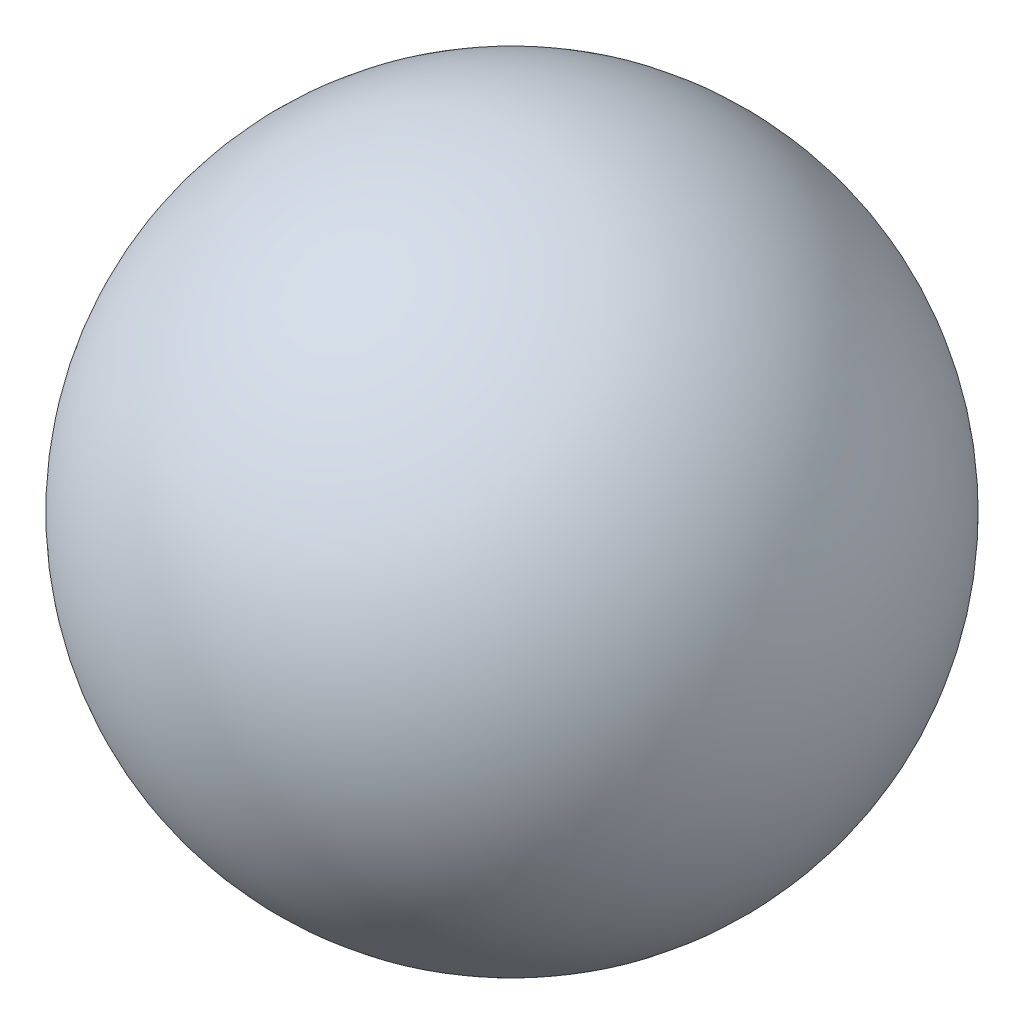
ISO-10303-21;
HEADER;
FILE_DESCRIPTION(('STEP AP214'),'2;1');
FILE_NAME('part.step','',(''),(''),'','','');
FILE_SCHEMA(('AUTOMOTIVE_DESIGN { 1 0 10303 214 1 1 1 1 }'));
ENDSEC;
DATA;
#1=APPLICATION_CONTEXT('core data for automotive mechanical design processes');
#2=APPLICATION_PROTOCOL_DEFINITION('international standard','automotive_design',2000,#1);
#3=PRODUCT_CONTEXT('',#1,'mechanical');
#4=PRODUCT('Part','Part','',(#3));
#5=PRODUCT_RELATED_PRODUCT_CATEGORY('part','',(#4));
#6=PRODUCT_DEFINITION_FORMATION('','',#4);
#7=PRODUCT_DEFINITION_CONTEXT('part definition',#1,'design');
#8=PRODUCT_DEFINITION('design','',#6,#7);
#9=PRODUCT_DEFINITION_SHAPE('','',#8);
#10=(LENGTH_UNIT() NAMED_UNIT(*) SI_UNIT(.MILLI.,.METRE.));
#11=(NAMED_UNIT(*) PLANE_ANGLE_UNIT() SI_UNIT($,.RADIAN.));
#12=(NAMED_UNIT(*) SI_UNIT($,.STERADIAN.) SOLID_ANGLE_UNIT());
#13=UNCERTAINTY_MEASURE_WITH_UNIT(LENGTH_MEASURE(1.E-05),#10,'distance_accuracy_value','');
#14=(GEOMETRIC_REPRESENTATION_CONTEXT(3) GLOBAL_UNCERTAINTY_ASSIGNED_CONTEXT((#13)) GLOBAL_UNIT_ASSIGNED_CONTEXT((#10,
#11,#12)) REPRESENTATION_CONTEXT('',''));
#15=CARTESIAN_POINT('',(0.,0.,0.));
#16=DIRECTION('',(0.,0.,1.));
#17=DIRECTION('',(1.,0.,0.));
#18=AXIS2_PLACEMENT_3D('',#15,#16,#17);
#19=CARTESIAN_POINT('',(0.,0.,0.));
#20=DIRECTION('',(0.,-1.,0.));
#21=DIRECTION('',(-1.,0.,0.));
#22=AXIS2_PLACEMENT_3D('',#19,#20,#21);
#23=SPHERICAL_SURFACE('',#22,21.5);
#24=CARTESIAN_POINT('',(0.,-21.5,0.));
#25=VERTEX_POINT('',#24);
#26=VERTEX_LOOP('',#25);
#27=FACE_BOUND('',#26,.T.);
#28=ADVANCED_FACE('F28',(#27),#23,.T.);
#29=CLOSED_SHELL('',(#28));
#30=MANIFOLD_SOLID_BREP('B2',#29);
#31=ADVANCED_BREP_SHAPE_REPRESENTATION('',(#18,#30),#14);
#32=SHAPE_DEFINITION_REPRESENTATION(#9,#31);
ENDSEC;
END-ISO-10303-21;
